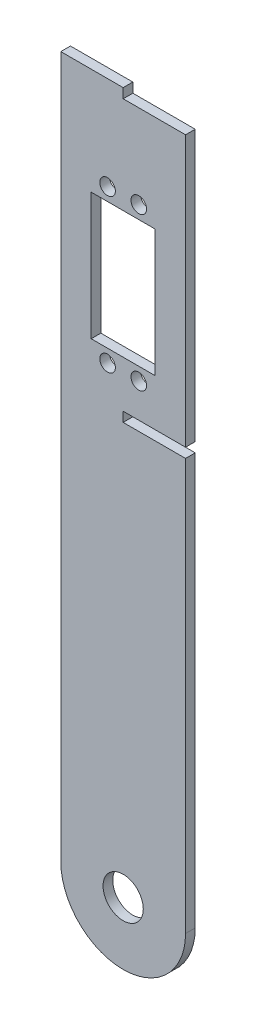
ISO-10303-21;
HEADER;
FILE_DESCRIPTION(('STEP AP214'),'2;1');
FILE_NAME('part.step','',(''),(''),'','','');
FILE_SCHEMA(('AUTOMOTIVE_DESIGN { 1 0 10303 214 1 1 1 1 }'));
ENDSEC;
DATA;
#1=APPLICATION_CONTEXT('core data for automotive mechanical design processes');
#2=APPLICATION_PROTOCOL_DEFINITION('international standard','automotive_design',2000,#1);
#3=PRODUCT_CONTEXT('',#1,'mechanical');
#4=PRODUCT('Part','Part','',(#3));
#5=PRODUCT_RELATED_PRODUCT_CATEGORY('part','',(#4));
#6=PRODUCT_DEFINITION_FORMATION('','',#4);
#7=PRODUCT_DEFINITION_CONTEXT('part definition',#1,'design');
#8=PRODUCT_DEFINITION('design','',#6,#7);
#9=PRODUCT_DEFINITION_SHAPE('','',#8);
#10=(LENGTH_UNIT() NAMED_UNIT(*) SI_UNIT(.MILLI.,.METRE.));
#11=(NAMED_UNIT(*) PLANE_ANGLE_UNIT() SI_UNIT($,.RADIAN.));
#12=(NAMED_UNIT(*) SI_UNIT($,.STERADIAN.) SOLID_ANGLE_UNIT());
#13=UNCERTAINTY_MEASURE_WITH_UNIT(LENGTH_MEASURE(1.E-05),#10,'distance_accuracy_value','');
#14=(GEOMETRIC_REPRESENTATION_CONTEXT(3) GLOBAL_UNCERTAINTY_ASSIGNED_CONTEXT((#13)) GLOBAL_UNIT_ASSIGNED_CONTEXT((#10,
#11,#12)) REPRESENTATION_CONTEXT('',''));
#15=CARTESIAN_POINT('',(0.,0.,0.));
#16=DIRECTION('',(0.,0.,1.));
#17=DIRECTION('',(1.,0.,0.));
#18=AXIS2_PLACEMENT_3D('',#15,#16,#17);
#19=CARTESIAN_POINT('',(20.,0.,3.1));
#20=DIRECTION('',(-1.,0.,0.));
#21=DIRECTION('',(0.,0.,1.));
#22=AXIS2_PLACEMENT_3D('',#19,#20,#21);
#23=PLANE('',#22);
#24=DIRECTION('',(0.,1.,0.));
#25=VECTOR('',#24,1.);
#26=CARTESIAN_POINT('',(20.,0.,3.1));
#27=LINE('',#26,#25);
#28=CARTESIAN_POINT('',(20.,135.,3.1));
#29=VERTEX_POINT('',#28);
#30=CARTESIAN_POINT('',(20.,221.75,3.1));
#31=VERTEX_POINT('',#30);
#32=EDGE_CURVE('E250',#29,#31,#27,.T.);
#33=ORIENTED_EDGE('',*,*,#32,.F.);
#34=DIRECTION('',(0.,0.,1.));
#35=VECTOR('',#34,1.);
#36=CARTESIAN_POINT('',(20.,135.,0.));
#37=LINE('',#36,#35);
#38=CARTESIAN_POINT('',(20.,135.,0.));
#39=VERTEX_POINT('',#38);
#40=EDGE_CURVE('E167',#39,#29,#37,.T.);
#41=ORIENTED_EDGE('',*,*,#40,.F.);
#42=DIRECTION('',(0.,1.,0.));
#43=VECTOR('',#42,1.);
#44=CARTESIAN_POINT('',(20.,0.,0.));
#45=LINE('',#44,#43);
#46=CARTESIAN_POINT('',(20.,221.75,0.));
#47=VERTEX_POINT('',#46);
#48=EDGE_CURVE('E159',#39,#47,#45,.T.);
#49=ORIENTED_EDGE('',*,*,#48,.T.);
#50=DIRECTION('',(0.,0.,1.));
#51=VECTOR('',#50,1.);
#52=CARTESIAN_POINT('',(20.,221.75,3.1));
#53=LINE('',#52,#51);
#54=EDGE_CURVE('E11',#47,#31,#53,.T.);
#55=ORIENTED_EDGE('',*,*,#54,.T.);
#56=EDGE_LOOP('',(#33,#41,#49,#55));
#57=FACE_BOUND('',#56,.T.);
#58=ADVANCED_FACE('F34',(#57),#23,.F.);
#59=CARTESIAN_POINT('',(0.,0.,3.1));
#60=DIRECTION('',(0.,0.,-1.));
#61=DIRECTION('',(-1.,0.,0.));
#62=AXIS2_PLACEMENT_3D('',#59,#60,#61);
#63=PLANE('',#62);
#64=CARTESIAN_POINT('',(-5.,194.85,3.1));
#65=DIRECTION('',(0.,0.,1.));
#66=DIRECTION('',(1.,0.,0.));
#67=AXIS2_PLACEMENT_3D('',#64,#65,#66);
#68=CIRCLE('',#67,2.5);
#69=CARTESIAN_POINT('',(-2.5,194.85,3.1));
#70=VERTEX_POINT('',#69);
#71=EDGE_CURVE('E192',#70,#70,#68,.T.);
#72=ORIENTED_EDGE('',*,*,#71,.F.);
#73=EDGE_LOOP('',(#72));
#74=FACE_BOUND('',#73,.T.);
#75=CARTESIAN_POINT('',(5.,145.85,3.1));
#76=DIRECTION('',(0.,0.,1.));
#77=DIRECTION('',(1.,0.,0.));
#78=AXIS2_PLACEMENT_3D('',#75,#76,#77);
#79=CIRCLE('',#78,2.5);
#80=CARTESIAN_POINT('',(7.5,145.85,3.1));
#81=VERTEX_POINT('',#80);
#82=EDGE_CURVE('E204',#81,#81,#79,.T.);
#83=ORIENTED_EDGE('',*,*,#82,.F.);
#84=EDGE_LOOP('',(#83));
#85=FACE_BOUND('',#84,.T.);
#86=CARTESIAN_POINT('',(0.,0.,3.1));
#87=DIRECTION('',(0.,0.,1.));
#88=DIRECTION('',(1.,0.,0.));
#89=AXIS2_PLACEMENT_3D('',#86,#87,#88);
#90=CIRCLE('',#89,6.45);
#91=CARTESIAN_POINT('',(6.45,0.,3.1));
#92=VERTEX_POINT('',#91);
#93=EDGE_CURVE('E241',#92,#92,#90,.T.);
#94=ORIENTED_EDGE('',*,*,#93,.F.);
#95=EDGE_LOOP('',(#94));
#96=FACE_BOUND('',#95,.T.);
#97=DIRECTION('',(0.,-1.,0.));
#98=VECTOR('',#97,1.);
#99=CARTESIAN_POINT('',(0.,135.,3.1));
#100=LINE('',#99,#98);
#101=CARTESIAN_POINT('',(0.,135.,3.1));
#102=VERTEX_POINT('',#101);
#103=CARTESIAN_POINT('',(0.,131.9,3.1));
#104=VERTEX_POINT('',#103);
#105=EDGE_CURVE('E161',#102,#104,#100,.T.);
#106=ORIENTED_EDGE('',*,*,#105,.F.);
#107=DIRECTION('',(-1.,0.,0.));
#108=VECTOR('',#107,1.);
#109=CARTESIAN_POINT('',(20.,135.,3.1));
#110=LINE('',#109,#108);
#111=EDGE_CURVE('E141',#29,#102,#110,.T.);
#112=ORIENTED_EDGE('',*,*,#111,.F.);
#113=ORIENTED_EDGE('',*,*,#32,.T.);
#114=DIRECTION('',(1.,0.,0.));
#115=VECTOR('',#114,1.);
#116=CARTESIAN_POINT('',(0.,221.75,3.1));
#117=LINE('',#116,#115);
#118=CARTESIAN_POINT('',(0.,221.75,3.1));
#119=VERTEX_POINT('',#118);
#120=EDGE_CURVE('E175',#119,#31,#117,.T.);
#121=ORIENTED_EDGE('',*,*,#120,.F.);
#122=DIRECTION('',(0.,-1.,0.));
#123=VECTOR('',#122,1.);
#124=CARTESIAN_POINT('',(0.,224.85,3.1));
#125=LINE('',#124,#123);
#126=CARTESIAN_POINT('',(0.,224.85,3.1));
#127=VERTEX_POINT('',#126);
#128=EDGE_CURVE('E169',#127,#119,#125,.T.);
#129=ORIENTED_EDGE('',*,*,#128,.F.);
#130=DIRECTION('',(-1.,0.,0.));
#131=VECTOR('',#130,1.);
#132=CARTESIAN_POINT('',(-20.,224.85,3.1));
#133=LINE('',#132,#131);
#134=CARTESIAN_POINT('',(-20.,224.85,3.1));
#135=VERTEX_POINT('',#134);
#136=EDGE_CURVE('E255',#127,#135,#133,.T.);
#137=ORIENTED_EDGE('',*,*,#136,.T.);
#138=DIRECTION('',(0.,-1.,0.));
#139=VECTOR('',#138,1.);
#140=CARTESIAN_POINT('',(-20.,0.,3.1));
#141=LINE('',#140,#139);
#142=CARTESIAN_POINT('',(-20.,0.,3.1));
#143=VERTEX_POINT('',#142);
#144=EDGE_CURVE('E257',#135,#143,#141,.T.);
#145=ORIENTED_EDGE('',*,*,#144,.T.);
#146=CARTESIAN_POINT('',(0.,0.,3.1));
#147=DIRECTION('',(0.,0.,1.));
#148=DIRECTION('',(-1.,0.,0.));
#149=AXIS2_PLACEMENT_3D('',#146,#147,#148);
#150=CIRCLE('',#149,20.);
#151=CARTESIAN_POINT('',(20.,0.,3.1));
#152=VERTEX_POINT('',#151);
#153=EDGE_CURVE('E247',#143,#152,#150,.T.);
#154=ORIENTED_EDGE('',*,*,#153,.T.);
#155=CARTESIAN_POINT('',(20.,131.9,3.1));
#156=VERTEX_POINT('',#155);
#157=EDGE_CURVE('E252',#152,#156,#27,.T.);
#158=ORIENTED_EDGE('',*,*,#157,.T.);
#159=DIRECTION('',(1.,0.,0.));
#160=VECTOR('',#159,1.);
#161=CARTESIAN_POINT('',(20.,131.9,3.1));
#162=LINE('',#161,#160);
#163=EDGE_CURVE('E49',#104,#156,#162,.T.);
#164=ORIENTED_EDGE('',*,*,#163,.F.);
#165=EDGE_LOOP('',(#106,#112,#113,#121,#129,#137,#145,#154,#158,#164));
#166=FACE_BOUND('',#165,.T.);
#167=DIRECTION('',(0.,1.,0.));
#168=VECTOR('',#167,1.);
#169=CARTESIAN_POINT('',(10.25,190.7,3.1));
#170=LINE('',#169,#168);
#171=CARTESIAN_POINT('',(10.25,150.,3.1));
#172=VERTEX_POINT('',#171);
#173=CARTESIAN_POINT('',(10.25,190.7,3.1));
#174=VERTEX_POINT('',#173);
#175=EDGE_CURVE('E210',#172,#174,#170,.T.);
#176=ORIENTED_EDGE('',*,*,#175,.F.);
#177=DIRECTION('',(1.,0.,0.));
#178=VECTOR('',#177,1.);
#179=CARTESIAN_POINT('',(-10.25,150.,3.1));
#180=LINE('',#179,#178);
#181=CARTESIAN_POINT('',(-10.25,150.,3.1));
#182=VERTEX_POINT('',#181);
#183=EDGE_CURVE('E218',#182,#172,#180,.T.);
#184=ORIENTED_EDGE('',*,*,#183,.F.);
#185=DIRECTION('',(0.,-1.,0.));
#186=VECTOR('',#185,1.);
#187=CARTESIAN_POINT('',(-10.25,190.7,3.1));
#188=LINE('',#187,#186);
#189=CARTESIAN_POINT('',(-10.25,190.7,3.1));
#190=VERTEX_POINT('',#189);
#191=EDGE_CURVE('E215',#190,#182,#188,.T.);
#192=ORIENTED_EDGE('',*,*,#191,.F.);
#193=DIRECTION('',(-1.,0.,0.));
#194=VECTOR('',#193,1.);
#195=CARTESIAN_POINT('',(-10.25,190.7,3.1));
#196=LINE('',#195,#194);
#197=EDGE_CURVE('E212',#174,#190,#196,.T.);
#198=ORIENTED_EDGE('',*,*,#197,.F.);
#199=EDGE_LOOP('',(#176,#184,#192,#198));
#200=FACE_BOUND('',#199,.T.);
#201=CARTESIAN_POINT('',(-5.,145.85,3.1));
#202=DIRECTION('',(0.,0.,1.));
#203=DIRECTION('',(-1.,0.,0.));
#204=AXIS2_PLACEMENT_3D('',#201,#202,#203);
#205=CIRCLE('',#204,2.5);
#206=CARTESIAN_POINT('',(-7.5,145.85,3.1));
#207=VERTEX_POINT('',#206);
#208=EDGE_CURVE('E198',#207,#207,#205,.T.);
#209=ORIENTED_EDGE('',*,*,#208,.F.);
#210=EDGE_LOOP('',(#209));
#211=FACE_BOUND('',#210,.T.);
#212=CARTESIAN_POINT('',(5.,194.85,3.1));
#213=DIRECTION('',(0.,0.,1.));
#214=DIRECTION('',(-1.,0.,0.));
#215=AXIS2_PLACEMENT_3D('',#212,#213,#214);
#216=CIRCLE('',#215,2.5);
#217=CARTESIAN_POINT('',(2.5,194.85,3.1));
#218=VERTEX_POINT('',#217);
#219=EDGE_CURVE('E186',#218,#218,#216,.T.);
#220=ORIENTED_EDGE('',*,*,#219,.F.);
#221=EDGE_LOOP('',(#220));
#222=FACE_BOUND('',#221,.T.);
#223=ADVANCED_FACE('F284',(#74,#85,#96,#166,#200,#211,#222),#63,.F.);
#224=CARTESIAN_POINT('',(0.,0.,0.));
#225=DIRECTION('',(0.,0.,-1.));
#226=DIRECTION('',(-1.,0.,0.));
#227=AXIS2_PLACEMENT_3D('',#224,#225,#226);
#228=PLANE('',#227);
#229=DIRECTION('',(-1.,0.,0.));
#230=VECTOR('',#229,1.);
#231=CARTESIAN_POINT('',(20.,135.,0.));
#232=LINE('',#231,#230);
#233=CARTESIAN_POINT('',(0.,135.,0.));
#234=VERTEX_POINT('',#233);
#235=EDGE_CURVE('E138',#39,#234,#232,.T.);
#236=ORIENTED_EDGE('',*,*,#235,.T.);
#237=DIRECTION('',(0.,-1.,0.));
#238=VECTOR('',#237,1.);
#239=CARTESIAN_POINT('',(0.,135.,0.));
#240=LINE('',#239,#238);
#241=CARTESIAN_POINT('',(0.,131.9,0.));
#242=VERTEX_POINT('',#241);
#243=EDGE_CURVE('E149',#234,#242,#240,.T.);
#244=ORIENTED_EDGE('',*,*,#243,.T.);
#245=DIRECTION('',(1.,0.,0.));
#246=VECTOR('',#245,1.);
#247=CARTESIAN_POINT('',(20.,131.9,0.));
#248=LINE('',#247,#246);
#249=CARTESIAN_POINT('',(20.,131.9,0.));
#250=VERTEX_POINT('',#249);
#251=EDGE_CURVE('E146',#242,#250,#248,.T.);
#252=ORIENTED_EDGE('',*,*,#251,.T.);
#253=CARTESIAN_POINT('',(20.,0.,0.));
#254=VERTEX_POINT('',#253);
#255=EDGE_CURVE('E262',#254,#250,#45,.T.);
#256=ORIENTED_EDGE('',*,*,#255,.F.);
#257=CARTESIAN_POINT('',(0.,0.,0.));
#258=DIRECTION('',(0.,0.,1.));
#259=DIRECTION('',(-1.,0.,0.));
#260=AXIS2_PLACEMENT_3D('',#257,#258,#259);
#261=CIRCLE('',#260,20.);
#262=CARTESIAN_POINT('',(-20.,0.,0.));
#263=VERTEX_POINT('',#262);
#264=EDGE_CURVE('E244',#263,#254,#261,.T.);
#265=ORIENTED_EDGE('',*,*,#264,.F.);
#266=DIRECTION('',(0.,-1.,0.));
#267=VECTOR('',#266,1.);
#268=CARTESIAN_POINT('',(-20.,0.,0.));
#269=LINE('',#268,#267);
#270=CARTESIAN_POINT('',(-20.,224.85,0.));
#271=VERTEX_POINT('',#270);
#272=EDGE_CURVE('E251',#271,#263,#269,.T.);
#273=ORIENTED_EDGE('',*,*,#272,.F.);
#274=DIRECTION('',(-1.,0.,0.));
#275=VECTOR('',#274,1.);
#276=CARTESIAN_POINT('',(-20.,224.85,0.));
#277=LINE('',#276,#275);
#278=CARTESIAN_POINT('',(0.,224.85,0.));
#279=VERTEX_POINT('',#278);
#280=EDGE_CURVE('E265',#279,#271,#277,.T.);
#281=ORIENTED_EDGE('',*,*,#280,.F.);
#282=DIRECTION('',(0.,-1.,0.));
#283=VECTOR('',#282,1.);
#284=CARTESIAN_POINT('',(0.,224.85,0.));
#285=LINE('',#284,#283);
#286=CARTESIAN_POINT('',(0.,221.75,0.));
#287=VERTEX_POINT('',#286);
#288=EDGE_CURVE('E57',#279,#287,#285,.T.);
#289=ORIENTED_EDGE('',*,*,#288,.T.);
#290=DIRECTION('',(1.,0.,0.));
#291=VECTOR('',#290,1.);
#292=CARTESIAN_POINT('',(0.,221.75,0.));
#293=LINE('',#292,#291);
#294=EDGE_CURVE('E174',#287,#47,#293,.T.);
#295=ORIENTED_EDGE('',*,*,#294,.T.);
#296=ORIENTED_EDGE('',*,*,#48,.F.);
#297=EDGE_LOOP('',(#236,#244,#252,#256,#265,#273,#281,#289,#295,#296));
#298=FACE_BOUND('',#297,.T.);
#299=CARTESIAN_POINT('',(-5.,194.85,0.));
#300=DIRECTION('',(0.,0.,1.));
#301=DIRECTION('',(1.,0.,0.));
#302=AXIS2_PLACEMENT_3D('',#299,#300,#301);
#303=CIRCLE('',#302,2.5);
#304=CARTESIAN_POINT('',(-2.5,194.85,0.));
#305=VERTEX_POINT('',#304);
#306=EDGE_CURVE('E189',#305,#305,#303,.T.);
#307=ORIENTED_EDGE('',*,*,#306,.T.);
#308=EDGE_LOOP('',(#307));
#309=FACE_BOUND('',#308,.T.);
#310=CARTESIAN_POINT('',(5.,145.85,0.));
#311=DIRECTION('',(0.,0.,1.));
#312=DIRECTION('',(1.,0.,0.));
#313=AXIS2_PLACEMENT_3D('',#310,#311,#312);
#314=CIRCLE('',#313,2.5);
#315=CARTESIAN_POINT('',(7.5,145.85,0.));
#316=VERTEX_POINT('',#315);
#317=EDGE_CURVE('E201',#316,#316,#314,.T.);
#318=ORIENTED_EDGE('',*,*,#317,.T.);
#319=EDGE_LOOP('',(#318));
#320=FACE_BOUND('',#319,.T.);
#321=CARTESIAN_POINT('',(0.,0.,0.));
#322=DIRECTION('',(0.,0.,1.));
#323=DIRECTION('',(1.,0.,0.));
#324=AXIS2_PLACEMENT_3D('',#321,#322,#323);
#325=CIRCLE('',#324,6.45);
#326=CARTESIAN_POINT('',(6.45,0.,0.));
#327=VERTEX_POINT('',#326);
#328=EDGE_CURVE('E240',#327,#327,#325,.T.);
#329=ORIENTED_EDGE('',*,*,#328,.T.);
#330=EDGE_LOOP('',(#329));
#331=FACE_BOUND('',#330,.T.);
#332=DIRECTION('',(1.,0.,0.));
#333=VECTOR('',#332,1.);
#334=CARTESIAN_POINT('',(-10.25,150.,0.));
#335=LINE('',#334,#333);
#336=CARTESIAN_POINT('',(-10.25,150.,0.));
#337=VERTEX_POINT('',#336);
#338=CARTESIAN_POINT('',(10.25,150.,0.));
#339=VERTEX_POINT('',#338);
#340=EDGE_CURVE('E213',#337,#339,#335,.T.);
#341=ORIENTED_EDGE('',*,*,#340,.T.);
#342=DIRECTION('',(0.,1.,0.));
#343=VECTOR('',#342,1.);
#344=CARTESIAN_POINT('',(10.25,190.7,0.));
#345=LINE('',#344,#343);
#346=CARTESIAN_POINT('',(10.25,190.7,0.));
#347=VERTEX_POINT('',#346);
#348=EDGE_CURVE('E207',#339,#347,#345,.T.);
#349=ORIENTED_EDGE('',*,*,#348,.T.);
#350=DIRECTION('',(-1.,0.,0.));
#351=VECTOR('',#350,1.);
#352=CARTESIAN_POINT('',(-10.25,190.7,0.));
#353=LINE('',#352,#351);
#354=CARTESIAN_POINT('',(-10.25,190.7,0.));
#355=VERTEX_POINT('',#354);
#356=EDGE_CURVE('E223',#347,#355,#353,.T.);
#357=ORIENTED_EDGE('',*,*,#356,.T.);
#358=DIRECTION('',(0.,-1.,0.));
#359=VECTOR('',#358,1.);
#360=CARTESIAN_POINT('',(-10.25,190.7,0.));
#361=LINE('',#360,#359);
#362=EDGE_CURVE('E226',#355,#337,#361,.T.);
#363=ORIENTED_EDGE('',*,*,#362,.T.);
#364=EDGE_LOOP('',(#341,#349,#357,#363));
#365=FACE_BOUND('',#364,.T.);
#366=CARTESIAN_POINT('',(-5.,145.85,0.));
#367=DIRECTION('',(0.,0.,1.));
#368=DIRECTION('',(-1.,0.,0.));
#369=AXIS2_PLACEMENT_3D('',#366,#367,#368);
#370=CIRCLE('',#369,2.5);
#371=CARTESIAN_POINT('',(-7.5,145.85,0.));
#372=VERTEX_POINT('',#371);
#373=EDGE_CURVE('E195',#372,#372,#370,.T.);
#374=ORIENTED_EDGE('',*,*,#373,.T.);
#375=EDGE_LOOP('',(#374));
#376=FACE_BOUND('',#375,.T.);
#377=CARTESIAN_POINT('',(5.,194.85,0.));
#378=DIRECTION('',(0.,0.,1.));
#379=DIRECTION('',(-1.,0.,0.));
#380=AXIS2_PLACEMENT_3D('',#377,#378,#379);
#381=CIRCLE('',#380,2.5);
#382=CARTESIAN_POINT('',(2.5,194.85,0.));
#383=VERTEX_POINT('',#382);
#384=EDGE_CURVE('E184',#383,#383,#381,.T.);
#385=ORIENTED_EDGE('',*,*,#384,.T.);
#386=EDGE_LOOP('',(#385));
#387=FACE_BOUND('',#386,.T.);
#388=ADVANCED_FACE('F156',(#298,#309,#320,#331,#365,#376,#387),#228,.T.);
#389=CARTESIAN_POINT('',(0.,0.,3.1));
#390=DIRECTION('',(0.,0.,-1.));
#391=DIRECTION('',(-1.,0.,0.));
#392=AXIS2_PLACEMENT_3D('',#389,#390,#391);
#393=CYLINDRICAL_SURFACE('',#392,20.);
#394=ORIENTED_EDGE('',*,*,#264,.T.);
#395=DIRECTION('',(0.,0.,-1.));
#396=VECTOR('',#395,1.);
#397=CARTESIAN_POINT('',(20.,0.,3.1));
#398=LINE('',#397,#396);
#399=EDGE_CURVE('E42',#152,#254,#398,.T.);
#400=ORIENTED_EDGE('',*,*,#399,.F.);
#401=ORIENTED_EDGE('',*,*,#153,.F.);
#402=DIRECTION('',(0.,0.,-1.));
#403=VECTOR('',#402,1.);
#404=CARTESIAN_POINT('',(-20.,0.,3.1));
#405=LINE('',#404,#403);
#406=EDGE_CURVE('E259',#143,#263,#405,.T.);
#407=ORIENTED_EDGE('',*,*,#406,.T.);
#408=EDGE_LOOP('',(#394,#400,#401,#407));
#409=FACE_BOUND('',#408,.T.);
#410=ADVANCED_FACE('F36',(#409),#393,.T.);
#411=ORIENTED_EDGE('',*,*,#255,.T.);
#412=DIRECTION('',(0.,0.,1.));
#413=VECTOR('',#412,1.);
#414=CARTESIAN_POINT('',(20.,131.9,0.));
#415=LINE('',#414,#413);
#416=EDGE_CURVE('E170',#250,#156,#415,.T.);
#417=ORIENTED_EDGE('',*,*,#416,.T.);
#418=ORIENTED_EDGE('',*,*,#157,.F.);
#419=ORIENTED_EDGE('',*,*,#399,.T.);
#420=EDGE_LOOP('',(#411,#417,#418,#419));
#421=FACE_BOUND('',#420,.T.);
#422=ADVANCED_FACE('F275',(#421),#23,.F.);
#423=CARTESIAN_POINT('',(-20.,224.85,3.1));
#424=DIRECTION('',(0.,-1.,0.));
#425=DIRECTION('',(0.,0.,-1.));
#426=AXIS2_PLACEMENT_3D('',#423,#424,#425);
#427=PLANE('',#426);
#428=ORIENTED_EDGE('',*,*,#136,.F.);
#429=DIRECTION('',(0.,0.,1.));
#430=VECTOR('',#429,1.);
#431=CARTESIAN_POINT('',(0.,224.85,0.));
#432=LINE('',#431,#430);
#433=EDGE_CURVE('E177',#279,#127,#432,.T.);
#434=ORIENTED_EDGE('',*,*,#433,.F.);
#435=ORIENTED_EDGE('',*,*,#280,.T.);
#436=DIRECTION('',(0.,0.,-1.));
#437=VECTOR('',#436,1.);
#438=CARTESIAN_POINT('',(-20.,224.85,3.1));
#439=LINE('',#438,#437);
#440=EDGE_CURVE('E270',#135,#271,#439,.T.);
#441=ORIENTED_EDGE('',*,*,#440,.F.);
#442=EDGE_LOOP('',(#428,#434,#435,#441));
#443=FACE_BOUND('',#442,.T.);
#444=ADVANCED_FACE('F293',(#443),#427,.F.);
#445=CARTESIAN_POINT('',(-20.,0.,3.1));
#446=DIRECTION('',(1.,0.,0.));
#447=DIRECTION('',(0.,0.,-1.));
#448=AXIS2_PLACEMENT_3D('',#445,#446,#447);
#449=PLANE('',#448);
#450=ORIENTED_EDGE('',*,*,#272,.T.);
#451=ORIENTED_EDGE('',*,*,#406,.F.);
#452=ORIENTED_EDGE('',*,*,#144,.F.);
#453=ORIENTED_EDGE('',*,*,#440,.T.);
#454=EDGE_LOOP('',(#450,#451,#452,#453));
#455=FACE_BOUND('',#454,.T.);
#456=ADVANCED_FACE('F291',(#455),#449,.F.);
#457=CARTESIAN_POINT('',(0.,0.,3.1));
#458=DIRECTION('',(0.,0.,-1.));
#459=DIRECTION('',(-1.,0.,0.));
#460=AXIS2_PLACEMENT_3D('',#457,#458,#459);
#461=CYLINDRICAL_SURFACE('',#460,6.45);
#462=ORIENTED_EDGE('',*,*,#93,.T.);
#463=EDGE_LOOP('',(#462));
#464=FACE_BOUND('',#463,.T.);
#465=ORIENTED_EDGE('',*,*,#328,.F.);
#466=EDGE_LOOP('',(#465));
#467=FACE_BOUND('',#466,.T.);
#468=ADVANCED_FACE('F333',(#464,#467),#461,.F.);
#469=CARTESIAN_POINT('',(10.25,190.7,3.1));
#470=DIRECTION('',(-1.,0.,0.));
#471=DIRECTION('',(0.,-1.,0.));
#472=AXIS2_PLACEMENT_3D('',#469,#470,#471);
#473=PLANE('',#472);
#474=ORIENTED_EDGE('',*,*,#348,.F.);
#475=DIRECTION('',(0.,0.,-1.));
#476=VECTOR('',#475,1.);
#477=CARTESIAN_POINT('',(10.25,150.,3.1));
#478=LINE('',#477,#476);
#479=EDGE_CURVE('E220',#172,#339,#478,.T.);
#480=ORIENTED_EDGE('',*,*,#479,.F.);
#481=ORIENTED_EDGE('',*,*,#175,.T.);
#482=DIRECTION('',(0.,0.,-1.));
#483=VECTOR('',#482,1.);
#484=CARTESIAN_POINT('',(10.25,190.7,3.1));
#485=LINE('',#484,#483);
#486=EDGE_CURVE('E237',#174,#347,#485,.T.);
#487=ORIENTED_EDGE('',*,*,#486,.T.);
#488=EDGE_LOOP('',(#474,#480,#481,#487));
#489=FACE_BOUND('',#488,.T.);
#490=ADVANCED_FACE('F337',(#489),#473,.T.);
#491=CARTESIAN_POINT('',(-10.25,190.7,3.1));
#492=DIRECTION('',(0.,-1.,0.));
#493=DIRECTION('',(0.,0.,-1.));
#494=AXIS2_PLACEMENT_3D('',#491,#492,#493);
#495=PLANE('',#494);
#496=ORIENTED_EDGE('',*,*,#356,.F.);
#497=ORIENTED_EDGE('',*,*,#486,.F.);
#498=ORIENTED_EDGE('',*,*,#197,.T.);
#499=DIRECTION('',(0.,0.,-1.));
#500=VECTOR('',#499,1.);
#501=CARTESIAN_POINT('',(-10.25,190.7,3.1));
#502=LINE('',#501,#500);
#503=EDGE_CURVE('E235',#190,#355,#502,.T.);
#504=ORIENTED_EDGE('',*,*,#503,.T.);
#505=EDGE_LOOP('',(#496,#497,#498,#504));
#506=FACE_BOUND('',#505,.T.);
#507=ADVANCED_FACE('F342',(#506),#495,.T.);
#508=CARTESIAN_POINT('',(-10.25,190.7,3.1));
#509=DIRECTION('',(1.,0.,0.));
#510=DIRECTION('',(0.,1.,0.));
#511=AXIS2_PLACEMENT_3D('',#508,#509,#510);
#512=PLANE('',#511);
#513=ORIENTED_EDGE('',*,*,#362,.F.);
#514=ORIENTED_EDGE('',*,*,#503,.F.);
#515=ORIENTED_EDGE('',*,*,#191,.T.);
#516=DIRECTION('',(0.,0.,-1.));
#517=VECTOR('',#516,1.);
#518=CARTESIAN_POINT('',(-10.25,150.,3.1));
#519=LINE('',#518,#517);
#520=EDGE_CURVE('E233',#182,#337,#519,.T.);
#521=ORIENTED_EDGE('',*,*,#520,.T.);
#522=EDGE_LOOP('',(#513,#514,#515,#521));
#523=FACE_BOUND('',#522,.T.);
#524=ADVANCED_FACE('F349',(#523),#512,.T.);
#525=CARTESIAN_POINT('',(-10.25,150.,3.1));
#526=DIRECTION('',(0.,1.,0.));
#527=DIRECTION('',(0.,0.,1.));
#528=AXIS2_PLACEMENT_3D('',#525,#526,#527);
#529=PLANE('',#528);
#530=ORIENTED_EDGE('',*,*,#340,.F.);
#531=ORIENTED_EDGE('',*,*,#520,.F.);
#532=ORIENTED_EDGE('',*,*,#183,.T.);
#533=ORIENTED_EDGE('',*,*,#479,.T.);
#534=EDGE_LOOP('',(#530,#531,#532,#533));
#535=FACE_BOUND('',#534,.T.);
#536=ADVANCED_FACE('F353',(#535),#529,.T.);
#537=CARTESIAN_POINT('',(5.,145.85,3.1));
#538=DIRECTION('',(0.,0.,-1.));
#539=DIRECTION('',(-1.,0.,0.));
#540=AXIS2_PLACEMENT_3D('',#537,#538,#539);
#541=CYLINDRICAL_SURFACE('',#540,2.5);
#542=ORIENTED_EDGE('',*,*,#82,.T.);
#543=EDGE_LOOP('',(#542));
#544=FACE_BOUND('',#543,.T.);
#545=ORIENTED_EDGE('',*,*,#317,.F.);
#546=EDGE_LOOP('',(#545));
#547=FACE_BOUND('',#546,.T.);
#548=ADVANCED_FACE('F357',(#544,#547),#541,.F.);
#549=CARTESIAN_POINT('',(-5.,145.85,3.1));
#550=DIRECTION('',(0.,0.,-1.));
#551=DIRECTION('',(-1.,0.,0.));
#552=AXIS2_PLACEMENT_3D('',#549,#550,#551);
#553=CYLINDRICAL_SURFACE('',#552,2.5);
#554=ORIENTED_EDGE('',*,*,#208,.T.);
#555=EDGE_LOOP('',(#554));
#556=FACE_BOUND('',#555,.T.);
#557=ORIENTED_EDGE('',*,*,#373,.F.);
#558=EDGE_LOOP('',(#557));
#559=FACE_BOUND('',#558,.T.);
#560=ADVANCED_FACE('F361',(#556,#559),#553,.F.);
#561=CARTESIAN_POINT('',(-5.,194.85,3.1));
#562=DIRECTION('',(0.,0.,-1.));
#563=DIRECTION('',(-1.,0.,0.));
#564=AXIS2_PLACEMENT_3D('',#561,#562,#563);
#565=CYLINDRICAL_SURFACE('',#564,2.5);
#566=ORIENTED_EDGE('',*,*,#71,.T.);
#567=EDGE_LOOP('',(#566));
#568=FACE_BOUND('',#567,.T.);
#569=ORIENTED_EDGE('',*,*,#306,.F.);
#570=EDGE_LOOP('',(#569));
#571=FACE_BOUND('',#570,.T.);
#572=ADVANCED_FACE('F365',(#568,#571),#565,.F.);
#573=CARTESIAN_POINT('',(5.,194.85,3.1));
#574=DIRECTION('',(0.,0.,-1.));
#575=DIRECTION('',(-1.,0.,0.));
#576=AXIS2_PLACEMENT_3D('',#573,#574,#575);
#577=CYLINDRICAL_SURFACE('',#576,2.5);
#578=ORIENTED_EDGE('',*,*,#219,.T.);
#579=EDGE_LOOP('',(#578));
#580=FACE_BOUND('',#579,.T.);
#581=ORIENTED_EDGE('',*,*,#384,.F.);
#582=EDGE_LOOP('',(#581));
#583=FACE_BOUND('',#582,.T.);
#584=ADVANCED_FACE('F309',(#580,#583),#577,.F.);
#585=CARTESIAN_POINT('',(0.,221.75,0.));
#586=DIRECTION('',(0.,-1.,0.));
#587=DIRECTION('',(0.,0.,-1.));
#588=AXIS2_PLACEMENT_3D('',#585,#586,#587);
#589=PLANE('',#588);
#590=ORIENTED_EDGE('',*,*,#294,.F.);
#591=DIRECTION('',(0.,0.,1.));
#592=VECTOR('',#591,1.);
#593=CARTESIAN_POINT('',(0.,221.75,0.));
#594=LINE('',#593,#592);
#595=EDGE_CURVE('E182',#287,#119,#594,.T.);
#596=ORIENTED_EDGE('',*,*,#595,.T.);
#597=ORIENTED_EDGE('',*,*,#120,.T.);
#598=ORIENTED_EDGE('',*,*,#54,.F.);
#599=EDGE_LOOP('',(#590,#596,#597,#598));
#600=FACE_BOUND('',#599,.T.);
#601=ADVANCED_FACE('F297',(#600),#589,.F.);
#602=CARTESIAN_POINT('',(0.,224.85,0.));
#603=DIRECTION('',(-1.,0.,0.));
#604=DIRECTION('',(0.,-1.,0.));
#605=AXIS2_PLACEMENT_3D('',#602,#603,#604);
#606=PLANE('',#605);
#607=ORIENTED_EDGE('',*,*,#128,.T.);
#608=ORIENTED_EDGE('',*,*,#595,.F.);
#609=ORIENTED_EDGE('',*,*,#288,.F.);
#610=ORIENTED_EDGE('',*,*,#433,.T.);
#611=EDGE_LOOP('',(#607,#608,#609,#610));
#612=FACE_BOUND('',#611,.T.);
#613=ADVANCED_FACE('F301',(#612),#606,.F.);
#614=CARTESIAN_POINT('',(20.,135.,0.));
#615=DIRECTION('',(0.,1.,0.));
#616=DIRECTION('',(0.,0.,1.));
#617=AXIS2_PLACEMENT_3D('',#614,#615,#616);
#618=PLANE('',#617);
#619=ORIENTED_EDGE('',*,*,#111,.T.);
#620=DIRECTION('',(0.,0.,1.));
#621=VECTOR('',#620,1.);
#622=CARTESIAN_POINT('',(0.,135.,0.));
#623=LINE('',#622,#621);
#624=EDGE_CURVE('E134',#234,#102,#623,.T.);
#625=ORIENTED_EDGE('',*,*,#624,.F.);
#626=ORIENTED_EDGE('',*,*,#235,.F.);
#627=ORIENTED_EDGE('',*,*,#40,.T.);
#628=EDGE_LOOP('',(#619,#625,#626,#627));
#629=FACE_BOUND('',#628,.T.);
#630=ADVANCED_FACE('F136',(#629),#618,.F.);
#631=CARTESIAN_POINT('',(20.,131.9,0.));
#632=DIRECTION('',(0.,-1.,0.));
#633=DIRECTION('',(0.,0.,-1.));
#634=AXIS2_PLACEMENT_3D('',#631,#632,#633);
#635=PLANE('',#634);
#636=ORIENTED_EDGE('',*,*,#163,.T.);
#637=ORIENTED_EDGE('',*,*,#416,.F.);
#638=ORIENTED_EDGE('',*,*,#251,.F.);
#639=DIRECTION('',(0.,0.,1.));
#640=VECTOR('',#639,1.);
#641=CARTESIAN_POINT('',(0.,131.9,0.));
#642=LINE('',#641,#640);
#643=EDGE_CURVE('E145',#242,#104,#642,.T.);
#644=ORIENTED_EDGE('',*,*,#643,.T.);
#645=EDGE_LOOP('',(#636,#637,#638,#644));
#646=FACE_BOUND('',#645,.T.);
#647=ADVANCED_FACE('F282',(#646),#635,.F.);
#648=CARTESIAN_POINT('',(0.,135.,0.));
#649=DIRECTION('',(-1.,0.,0.));
#650=DIRECTION('',(0.,-1.,0.));
#651=AXIS2_PLACEMENT_3D('',#648,#649,#650);
#652=PLANE('',#651);
#653=ORIENTED_EDGE('',*,*,#105,.T.);
#654=ORIENTED_EDGE('',*,*,#643,.F.);
#655=ORIENTED_EDGE('',*,*,#243,.F.);
#656=ORIENTED_EDGE('',*,*,#624,.T.);
#657=EDGE_LOOP('',(#653,#654,#655,#656));
#658=FACE_BOUND('',#657,.T.);
#659=ADVANCED_FACE('F150',(#658),#652,.F.);
#660=CLOSED_SHELL('',(#58,#223,#388,#410,#422,#444,#456,#468,#490,#507,#524,#536,#548,#560,#572,
#584,#601,#613,#630,#647,#659));
#661=MANIFOLD_SOLID_BREP('B2',#660);
#662=ADVANCED_BREP_SHAPE_REPRESENTATION('',(#18,#661),#14);
#663=SHAPE_DEFINITION_REPRESENTATION(#9,#662);
ENDSEC;
END-ISO-10303-21;
